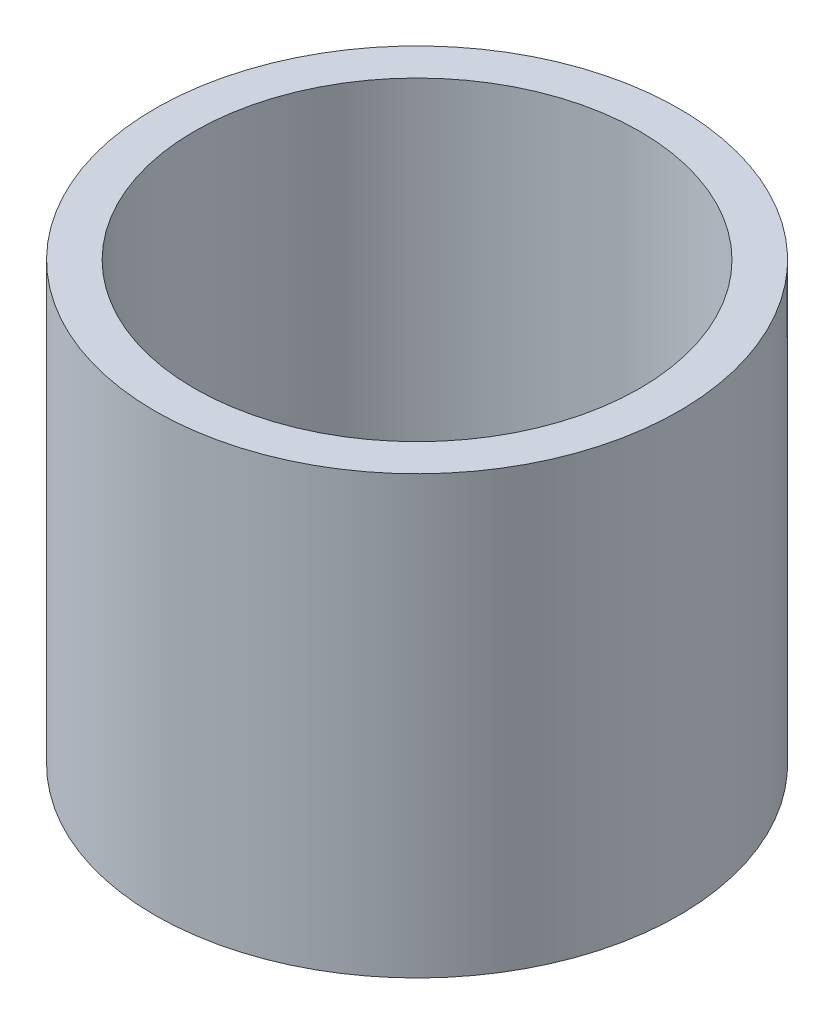
ISO-10303-21;
HEADER;
FILE_DESCRIPTION(('STEP AP214'),'2;1');
FILE_NAME('part.step','',(''),(''),'','','');
FILE_SCHEMA(('AUTOMOTIVE_DESIGN { 1 0 10303 214 1 1 1 1 }'));
ENDSEC;
DATA;
#1=APPLICATION_CONTEXT('core data for automotive mechanical design processes');
#2=APPLICATION_PROTOCOL_DEFINITION('international standard','automotive_design',2000,#1);
#3=PRODUCT_CONTEXT('',#1,'mechanical');
#4=PRODUCT('Part','Part','',(#3));
#5=PRODUCT_RELATED_PRODUCT_CATEGORY('part','',(#4));
#6=PRODUCT_DEFINITION_FORMATION('','',#4);
#7=PRODUCT_DEFINITION_CONTEXT('part definition',#1,'design');
#8=PRODUCT_DEFINITION('design','',#6,#7);
#9=PRODUCT_DEFINITION_SHAPE('','',#8);
#10=(LENGTH_UNIT() NAMED_UNIT(*) SI_UNIT(.MILLI.,.METRE.));
#11=(NAMED_UNIT(*) PLANE_ANGLE_UNIT() SI_UNIT($,.RADIAN.));
#12=(NAMED_UNIT(*) SI_UNIT($,.STERADIAN.) SOLID_ANGLE_UNIT());
#13=UNCERTAINTY_MEASURE_WITH_UNIT(LENGTH_MEASURE(1.E-05),#10,'distance_accuracy_value','');
#14=(GEOMETRIC_REPRESENTATION_CONTEXT(3) GLOBAL_UNCERTAINTY_ASSIGNED_CONTEXT((#13)) GLOBAL_UNIT_ASSIGNED_CONTEXT((#10,
#11,#12)) REPRESENTATION_CONTEXT('',''));
#15=CARTESIAN_POINT('',(0.,0.,0.));
#16=DIRECTION('',(0.,0.,1.));
#17=DIRECTION('',(1.,0.,0.));
#18=AXIS2_PLACEMENT_3D('',#15,#16,#17);
#19=CARTESIAN_POINT('',(2.15,-2.5,0.));
#20=DIRECTION('',(0.,1.,0.));
#21=DIRECTION('',(0.,0.,1.));
#22=AXIS2_PLACEMENT_3D('',#19,#20,#21);
#23=PLANE('',#22);
#24=CARTESIAN_POINT('',(0.,-2.5,0.));
#25=DIRECTION('',(0.,1.,0.));
#26=DIRECTION('',(0.,0.,1.));
#27=AXIS2_PLACEMENT_3D('',#24,#25,#26);
#28=CIRCLE('',#27,2.55);
#29=CARTESIAN_POINT('',(0.,-2.5,2.55));
#30=VERTEX_POINT('',#29);
#31=EDGE_CURVE('E39',#30,#30,#28,.T.);
#32=ORIENTED_EDGE('',*,*,#31,.T.);
#33=EDGE_LOOP('',(#32));
#34=FACE_BOUND('',#33,.T.);
#35=CARTESIAN_POINT('',(0.,-2.5,0.));
#36=DIRECTION('',(0.,1.,0.));
#37=DIRECTION('',(0.,0.,1.));
#38=AXIS2_PLACEMENT_3D('',#35,#36,#37);
#39=CIRCLE('',#38,3.);
#40=CARTESIAN_POINT('',(0.,-2.5,3.));
#41=VERTEX_POINT('',#40);
#42=EDGE_CURVE('E10',#41,#41,#39,.T.);
#43=ORIENTED_EDGE('',*,*,#42,.F.);
#44=EDGE_LOOP('',(#43));
#45=FACE_BOUND('',#44,.T.);
#46=ADVANCED_FACE('F29',(#34,#45),#23,.F.);
#47=CARTESIAN_POINT('',(0.,9.88621209950225,0.));
#48=DIRECTION('',(0.,1.,0.));
#49=DIRECTION('',(0.,0.,1.));
#50=AXIS2_PLACEMENT_3D('',#47,#48,#49);
#51=CYLINDRICAL_SURFACE('',#50,3.);
#52=CARTESIAN_POINT('',(0.,2.5,0.));
#53=DIRECTION('',(0.,1.,0.));
#54=DIRECTION('',(0.,0.,1.));
#55=AXIS2_PLACEMENT_3D('',#52,#53,#54);
#56=CIRCLE('',#55,3.);
#57=CARTESIAN_POINT('',(0.,2.5,3.));
#58=VERTEX_POINT('',#57);
#59=EDGE_CURVE('E35',#58,#58,#56,.T.);
#60=ORIENTED_EDGE('',*,*,#59,.F.);
#61=EDGE_LOOP('',(#60));
#62=FACE_BOUND('',#61,.T.);
#63=ORIENTED_EDGE('',*,*,#42,.T.);
#64=EDGE_LOOP('',(#63));
#65=FACE_BOUND('',#64,.T.);
#66=ADVANCED_FACE('F53',(#62,#65),#51,.T.);
#67=CARTESIAN_POINT('',(2.15,2.5,0.));
#68=DIRECTION('',(0.,-1.,0.));
#69=DIRECTION('',(0.,0.,-1.));
#70=AXIS2_PLACEMENT_3D('',#67,#68,#69);
#71=PLANE('',#70);
#72=CARTESIAN_POINT('',(0.,2.5,0.));
#73=DIRECTION('',(0.,1.,0.));
#74=DIRECTION('',(0.,0.,1.));
#75=AXIS2_PLACEMENT_3D('',#72,#73,#74);
#76=CIRCLE('',#75,2.55);
#77=CARTESIAN_POINT('',(0.,2.5,2.55));
#78=VERTEX_POINT('',#77);
#79=EDGE_CURVE('E43',#78,#78,#76,.T.);
#80=ORIENTED_EDGE('',*,*,#79,.F.);
#81=EDGE_LOOP('',(#80));
#82=FACE_BOUND('',#81,.T.);
#83=ORIENTED_EDGE('',*,*,#59,.T.);
#84=EDGE_LOOP('',(#83));
#85=FACE_BOUND('',#84,.T.);
#86=ADVANCED_FACE('F51',(#82,#85),#71,.F.);
#87=CARTESIAN_POINT('',(0.,-2.5,0.));
#88=DIRECTION('',(0.,1.,0.));
#89=DIRECTION('',(0.,0.,1.));
#90=AXIS2_PLACEMENT_3D('',#87,#88,#89);
#91=CYLINDRICAL_SURFACE('',#90,2.55);
#92=ORIENTED_EDGE('',*,*,#31,.F.);
#93=EDGE_LOOP('',(#92));
#94=FACE_BOUND('',#93,.T.);
#95=ORIENTED_EDGE('',*,*,#79,.T.);
#96=EDGE_LOOP('',(#95));
#97=FACE_BOUND('',#96,.T.);
#98=ADVANCED_FACE('F49',(#94,#97),#91,.F.);
#99=CLOSED_SHELL('',(#46,#66,#86,#98));
#100=MANIFOLD_SOLID_BREP('B2',#99);
#101=ADVANCED_BREP_SHAPE_REPRESENTATION('',(#18,#100),#14);
#102=SHAPE_DEFINITION_REPRESENTATION(#9,#101);
ENDSEC;
END-ISO-10303-21;
